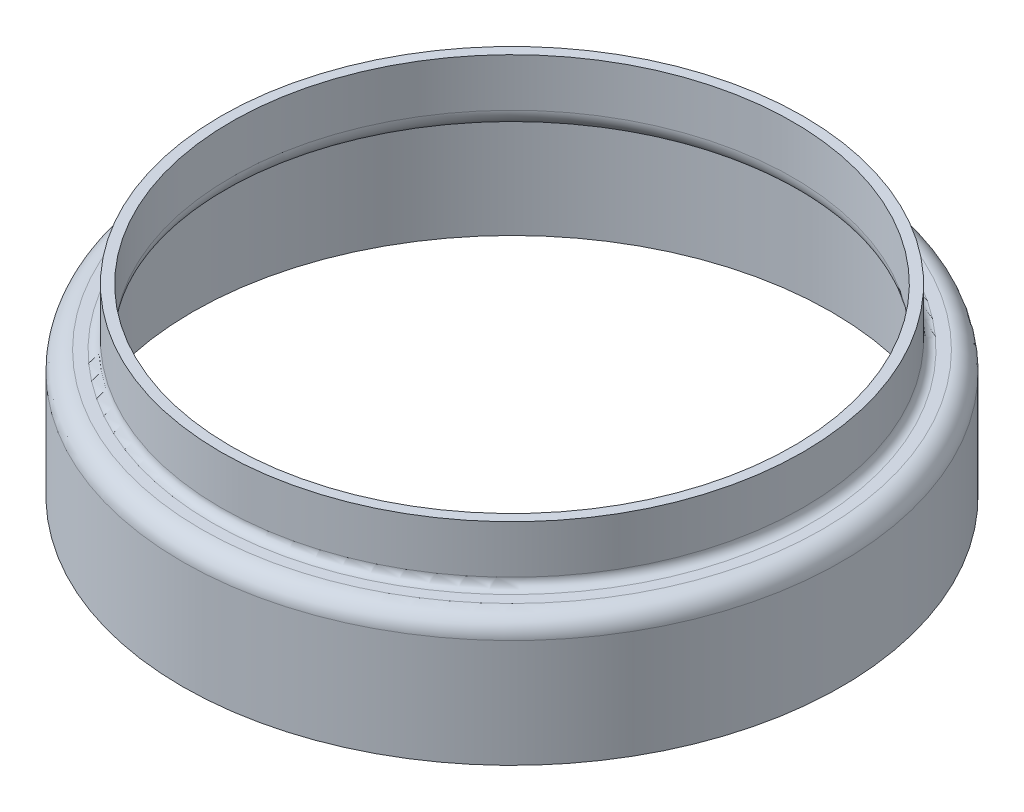
ISO-10303-21;
HEADER;
FILE_DESCRIPTION(('STEP AP214'),'2;1');
FILE_NAME('part.step','',(''),(''),'','','');
FILE_SCHEMA(('AUTOMOTIVE_DESIGN { 1 0 10303 214 1 1 1 1 }'));
ENDSEC;
DATA;
#1=APPLICATION_CONTEXT('core data for automotive mechanical design processes');
#2=APPLICATION_PROTOCOL_DEFINITION('international standard','automotive_design',2000,#1);
#3=PRODUCT_CONTEXT('',#1,'mechanical');
#4=PRODUCT('Part','Part','',(#3));
#5=PRODUCT_RELATED_PRODUCT_CATEGORY('part','',(#4));
#6=PRODUCT_DEFINITION_FORMATION('','',#4);
#7=PRODUCT_DEFINITION_CONTEXT('part definition',#1,'design');
#8=PRODUCT_DEFINITION('design','',#6,#7);
#9=PRODUCT_DEFINITION_SHAPE('','',#8);
#10=(LENGTH_UNIT() NAMED_UNIT(*) SI_UNIT(.MILLI.,.METRE.));
#11=(NAMED_UNIT(*) PLANE_ANGLE_UNIT() SI_UNIT($,.RADIAN.));
#12=(NAMED_UNIT(*) SI_UNIT($,.STERADIAN.) SOLID_ANGLE_UNIT());
#13=UNCERTAINTY_MEASURE_WITH_UNIT(LENGTH_MEASURE(1.E-05),#10,'distance_accuracy_value','');
#14=(GEOMETRIC_REPRESENTATION_CONTEXT(3) GLOBAL_UNCERTAINTY_ASSIGNED_CONTEXT((#13)) GLOBAL_UNIT_ASSIGNED_CONTEXT((#10,
#11,#12)) REPRESENTATION_CONTEXT('',''));
#15=CARTESIAN_POINT('',(0.,0.,0.));
#16=DIRECTION('',(0.,0.,1.));
#17=DIRECTION('',(1.,0.,0.));
#18=AXIS2_PLACEMENT_3D('',#15,#16,#17);
#19=CARTESIAN_POINT('',(0.,71.5790860873113,0.));
#20=DIRECTION('',(0.,1.,0.));
#21=DIRECTION('',(0.,0.,1.));
#22=AXIS2_PLACEMENT_3D('',#19,#20,#21);
#23=CYLINDRICAL_SURFACE('',#22,8.15339999999999);
#24=CARTESIAN_POINT('',(0.,4.57199999999999,0.));
#25=DIRECTION('',(0.,1.,0.));
#26=DIRECTION('',(0.,0.,1.));
#27=AXIS2_PLACEMENT_3D('',#24,#25,#26);
#28=CIRCLE('',#27,8.15339999999999);
#29=CARTESIAN_POINT('',(0.,4.57199999999999,8.15339999999999));
#30=VERTEX_POINT('',#29);
#31=EDGE_CURVE('E248',#30,#30,#28,.T.);
#32=ORIENTED_EDGE('',*,*,#31,.F.);
#33=EDGE_LOOP('',(#32));
#34=FACE_BOUND('',#33,.T.);
#35=CARTESIAN_POINT('',(0.,5.969,0.));
#36=DIRECTION('',(0.,1.,0.));
#37=DIRECTION('',(0.,0.,1.));
#38=AXIS2_PLACEMENT_3D('',#35,#36,#37);
#39=CIRCLE('',#38,8.15339999999999);
#40=CARTESIAN_POINT('',(0.,5.969,8.15339999999999));
#41=VERTEX_POINT('',#40);
#42=EDGE_CURVE('E63',#41,#41,#39,.T.);
#43=ORIENTED_EDGE('',*,*,#42,.T.);
#44=EDGE_LOOP('',(#43));
#45=FACE_BOUND('',#44,.T.);
#46=ADVANCED_FACE('F16',(#34,#45),#23,.F.);
#47=CARTESIAN_POINT('',(0.,4.572,0.));
#48=DIRECTION('',(0.,1.,0.));
#49=DIRECTION('',(0.,0.,1.));
#50=AXIS2_PLACEMENT_3D('',#47,#48,#49);
#51=TOROIDAL_SURFACE('',#50,8.69949999999999,0.5461);
#52=CARTESIAN_POINT('',(0.,4.0259,0.));
#53=DIRECTION('',(0.,-1.,0.));
#54=DIRECTION('',(0.,0.,1.));
#55=AXIS2_PLACEMENT_3D('',#52,#53,#54);
#56=CIRCLE('',#55,8.69949999999999);
#57=CARTESIAN_POINT('',(0.,4.0259,8.69949999999999));
#58=VERTEX_POINT('',#57);
#59=CARTESIAN_POINT('',(0.,4.0259,-8.69949999999999));
#60=VERTEX_POINT('',#59);
#61=EDGE_CURVE('E58',#58,#60,#56,.T.);
#62=ORIENTED_EDGE('',*,*,#61,.T.);
#63=CARTESIAN_POINT('',(0.,4.0259,0.));
#64=DIRECTION('',(0.,-1.,0.));
#65=DIRECTION('',(0.,0.,-1.));
#66=AXIS2_PLACEMENT_3D('',#63,#64,#65);
#67=CIRCLE('',#66,8.69949999999999);
#68=EDGE_CURVE('E55',#60,#58,#67,.T.);
#69=ORIENTED_EDGE('',*,*,#68,.T.);
#70=EDGE_LOOP('',(#62,#69));
#71=FACE_BOUND('',#70,.T.);
#72=ORIENTED_EDGE('',*,*,#31,.T.);
#73=EDGE_LOOP('',(#72));
#74=FACE_BOUND('',#73,.T.);
#75=ADVANCED_FACE('F59',(#71,#74),#51,.T.);
#76=CARTESIAN_POINT('',(0.,5.969,8.44549999999999));
#77=DIRECTION('',(0.,-1.,0.));
#78=DIRECTION('',(0.,0.,-1.));
#79=AXIS2_PLACEMENT_3D('',#76,#77,#78);
#80=PLANE('',#79);
#81=CARTESIAN_POINT('',(0.,5.969,0.));
#82=DIRECTION('',(0.,1.,0.));
#83=DIRECTION('',(0.,0.,1.));
#84=AXIS2_PLACEMENT_3D('',#81,#82,#83);
#85=CIRCLE('',#84,8.44549999999999);
#86=CARTESIAN_POINT('',(0.,5.969,8.44549999999999));
#87=VERTEX_POINT('',#86);
#88=EDGE_CURVE('E68',#87,#87,#85,.F.);
#89=ORIENTED_EDGE('',*,*,#88,.F.);
#90=EDGE_LOOP('',(#89));
#91=FACE_BOUND('',#90,.T.);
#92=ORIENTED_EDGE('',*,*,#42,.F.);
#93=EDGE_LOOP('',(#92));
#94=FACE_BOUND('',#93,.T.);
#95=ADVANCED_FACE('F89',(#91,#94),#80,.F.);
#96=CARTESIAN_POINT('',(0.,4.0259,8.69949999999999));
#97=DIRECTION('',(0.,1.,0.));
#98=DIRECTION('',(0.,0.,1.));
#99=AXIS2_PLACEMENT_3D('',#96,#97,#98);
#100=PLANE('',#99);
#101=ORIENTED_EDGE('',*,*,#61,.F.);
#102=ORIENTED_EDGE('',*,*,#68,.F.);
#103=EDGE_LOOP('',(#101,#102));
#104=FACE_BOUND('',#103,.T.);
#105=CARTESIAN_POINT('',(0.,4.0259,0.));
#106=DIRECTION('',(0.,1.,0.));
#107=DIRECTION('',(0.,0.,-1.));
#108=AXIS2_PLACEMENT_3D('',#105,#106,#107);
#109=CIRCLE('',#108,9.01699999999999);
#110=CARTESIAN_POINT('',(0.,4.0259,9.01699999999999));
#111=VERTEX_POINT('',#110);
#112=CARTESIAN_POINT('',(0.,4.0259,-9.01699999999999));
#113=VERTEX_POINT('',#112);
#114=EDGE_CURVE('E109',#111,#113,#109,.F.);
#115=ORIENTED_EDGE('',*,*,#114,.T.);
#116=CARTESIAN_POINT('',(0.,4.0259,0.));
#117=DIRECTION('',(0.,1.,0.));
#118=DIRECTION('',(0.,0.,1.));
#119=AXIS2_PLACEMENT_3D('',#116,#117,#118);
#120=CIRCLE('',#119,9.01699999999999);
#121=EDGE_CURVE('E108',#113,#111,#120,.F.);
#122=ORIENTED_EDGE('',*,*,#121,.T.);
#123=EDGE_LOOP('',(#115,#122));
#124=FACE_BOUND('',#123,.T.);
#125=ADVANCED_FACE('F66',(#104,#124),#100,.F.);
#126=CARTESIAN_POINT('',(0.,71.5790860873113,0.));
#127=DIRECTION('',(0.,1.,0.));
#128=DIRECTION('',(0.,0.,1.));
#129=AXIS2_PLACEMENT_3D('',#126,#127,#128);
#130=CYLINDRICAL_SURFACE('',#129,8.44549999999999);
#131=CARTESIAN_POINT('',(0.,4.57199999999999,0.));
#132=DIRECTION('',(0.,1.,0.));
#133=DIRECTION('',(0.,0.,1.));
#134=AXIS2_PLACEMENT_3D('',#131,#132,#133);
#135=CIRCLE('',#134,8.44549999999999);
#136=CARTESIAN_POINT('',(0.,4.57199999999999,8.44549999999999));
#137=VERTEX_POINT('',#136);
#138=EDGE_CURVE('E114',#137,#137,#135,.T.);
#139=ORIENTED_EDGE('',*,*,#138,.T.);
#140=EDGE_LOOP('',(#139));
#141=FACE_BOUND('',#140,.T.);
#142=ORIENTED_EDGE('',*,*,#88,.T.);
#143=EDGE_LOOP('',(#142));
#144=FACE_BOUND('',#143,.T.);
#145=ADVANCED_FACE('F88',(#141,#144),#130,.T.);
#146=CARTESIAN_POINT('',(0.,3.7719,0.));
#147=DIRECTION('',(0.,1.,0.));
#148=DIRECTION('',(0.,0.,1.));
#149=AXIS2_PLACEMENT_3D('',#146,#147,#148);
#150=TOROIDAL_SURFACE('',#149,9.01699999999999,0.254);
#151=ORIENTED_EDGE('',*,*,#114,.F.);
#152=ORIENTED_EDGE('',*,*,#121,.F.);
#153=EDGE_LOOP('',(#151,#152));
#154=FACE_BOUND('',#153,.T.);
#155=CARTESIAN_POINT('',(0.,3.77189999999999,0.));
#156=DIRECTION('',(0.,1.,0.));
#157=DIRECTION('',(0.,0.,1.));
#158=AXIS2_PLACEMENT_3D('',#155,#156,#157);
#159=CIRCLE('',#158,9.27099999999999);
#160=CARTESIAN_POINT('',(0.,3.77189999999999,9.27099999999999));
#161=VERTEX_POINT('',#160);
#162=EDGE_CURVE('E116',#161,#161,#159,.F.);
#163=ORIENTED_EDGE('',*,*,#162,.T.);
#164=EDGE_LOOP('',(#163));
#165=FACE_BOUND('',#164,.T.);
#166=ADVANCED_FACE('F112',(#154,#165),#150,.F.);
#167=CARTESIAN_POINT('',(0.,4.572,0.));
#168=DIRECTION('',(0.,1.,0.));
#169=DIRECTION('',(0.,0.,1.));
#170=AXIS2_PLACEMENT_3D('',#167,#168,#169);
#171=TOROIDAL_SURFACE('',#170,8.69949999999999,0.254);
#172=CARTESIAN_POINT('',(0.,4.318,0.));
#173=DIRECTION('',(0.,1.,0.));
#174=DIRECTION('',(0.,0.,-1.));
#175=AXIS2_PLACEMENT_3D('',#172,#173,#174);
#176=CIRCLE('',#175,8.69949999999999);
#177=CARTESIAN_POINT('',(0.,4.318,8.69949999999999));
#178=VERTEX_POINT('',#177);
#179=CARTESIAN_POINT('',(0.,4.318,-8.69949999999999));
#180=VERTEX_POINT('',#179);
#181=EDGE_CURVE('E212',#178,#180,#176,.F.);
#182=ORIENTED_EDGE('',*,*,#181,.F.);
#183=CARTESIAN_POINT('',(0.,4.318,0.));
#184=DIRECTION('',(0.,1.,0.));
#185=DIRECTION('',(0.,0.,1.));
#186=AXIS2_PLACEMENT_3D('',#183,#184,#185);
#187=CIRCLE('',#186,8.69949999999999);
#188=EDGE_CURVE('E121',#180,#178,#187,.F.);
#189=ORIENTED_EDGE('',*,*,#188,.F.);
#190=EDGE_LOOP('',(#182,#189));
#191=FACE_BOUND('',#190,.T.);
#192=ORIENTED_EDGE('',*,*,#138,.F.);
#193=EDGE_LOOP('',(#192));
#194=FACE_BOUND('',#193,.T.);
#195=ADVANCED_FACE('F129',(#191,#194),#171,.F.);
#196=CARTESIAN_POINT('',(0.,71.5790860873113,0.));
#197=DIRECTION('',(0.,1.,0.));
#198=DIRECTION('',(0.,0.,1.));
#199=AXIS2_PLACEMENT_3D('',#196,#197,#198);
#200=CYLINDRICAL_SURFACE('',#199,9.27099999999999);
#201=ORIENTED_EDGE('',*,*,#162,.F.);
#202=EDGE_LOOP('',(#201));
#203=FACE_BOUND('',#202,.T.);
#204=CARTESIAN_POINT('',(0.,0.634999999999997,0.));
#205=DIRECTION('',(0.,1.,0.));
#206=DIRECTION('',(0.,0.,1.));
#207=AXIS2_PLACEMENT_3D('',#204,#205,#206);
#208=CIRCLE('',#207,9.27099999999999);
#209=CARTESIAN_POINT('',(0.,0.634999999999997,9.27099999999999));
#210=VERTEX_POINT('',#209);
#211=EDGE_CURVE('E238',#210,#210,#208,.T.);
#212=ORIENTED_EDGE('',*,*,#211,.F.);
#213=EDGE_LOOP('',(#212));
#214=FACE_BOUND('',#213,.T.);
#215=ADVANCED_FACE('F194',(#203,#214),#200,.F.);
#216=CARTESIAN_POINT('',(0.,4.318,8.69949999999999));
#217=DIRECTION('',(0.,1.,0.));
#218=DIRECTION('',(0.,0.,1.));
#219=AXIS2_PLACEMENT_3D('',#216,#217,#218);
#220=PLANE('',#219);
#221=ORIENTED_EDGE('',*,*,#188,.T.);
#222=ORIENTED_EDGE('',*,*,#181,.T.);
#223=EDGE_LOOP('',(#221,#222));
#224=FACE_BOUND('',#223,.T.);
#225=CARTESIAN_POINT('',(0.,4.318,0.));
#226=DIRECTION('',(0.,-1.,0.));
#227=DIRECTION('',(0.,0.,-1.));
#228=AXIS2_PLACEMENT_3D('',#225,#226,#227);
#229=CIRCLE('',#228,9.01699999999999);
#230=CARTESIAN_POINT('',(0.,4.318,-9.01699999999999));
#231=VERTEX_POINT('',#230);
#232=CARTESIAN_POINT('',(0.,4.318,9.01699999999999));
#233=VERTEX_POINT('',#232);
#234=EDGE_CURVE('E182',#231,#233,#229,.T.);
#235=ORIENTED_EDGE('',*,*,#234,.F.);
#236=CARTESIAN_POINT('',(0.,4.318,0.));
#237=DIRECTION('',(0.,-1.,0.));
#238=DIRECTION('',(0.,0.,1.));
#239=AXIS2_PLACEMENT_3D('',#236,#237,#238);
#240=CIRCLE('',#239,9.01699999999999);
#241=EDGE_CURVE('E34',#233,#231,#240,.T.);
#242=ORIENTED_EDGE('',*,*,#241,.F.);
#243=EDGE_LOOP('',(#235,#242));
#244=FACE_BOUND('',#243,.T.);
#245=ADVANCED_FACE('F186',(#224,#244),#220,.T.);
#246=CARTESIAN_POINT('',(0.,0.634999999999997,-9.652));
#247=DIRECTION('',(0.,-1.,0.));
#248=DIRECTION('',(0.,0.,-1.));
#249=AXIS2_PLACEMENT_3D('',#246,#247,#248);
#250=PLANE('',#249);
#251=ORIENTED_EDGE('',*,*,#211,.T.);
#252=EDGE_LOOP('',(#251));
#253=FACE_BOUND('',#252,.T.);
#254=CARTESIAN_POINT('',(0.,0.634999999999997,0.));
#255=DIRECTION('',(0.,1.,0.));
#256=DIRECTION('',(0.,0.,1.));
#257=AXIS2_PLACEMENT_3D('',#254,#255,#256);
#258=CIRCLE('',#257,9.56309999999999);
#259=CARTESIAN_POINT('',(0.,0.634999999999997,9.56309999999999));
#260=VERTEX_POINT('',#259);
#261=EDGE_CURVE('E26',#260,#260,#258,.T.);
#262=ORIENTED_EDGE('',*,*,#261,.F.);
#263=EDGE_LOOP('',(#262));
#264=FACE_BOUND('',#263,.T.);
#265=ADVANCED_FACE('F174',(#253,#264),#250,.T.);
#266=CARTESIAN_POINT('',(0.,3.7719,0.));
#267=DIRECTION('',(0.,1.,0.));
#268=DIRECTION('',(0.,0.,1.));
#269=AXIS2_PLACEMENT_3D('',#266,#267,#268);
#270=TOROIDAL_SURFACE('',#269,9.01699999999999,0.5461);
#271=ORIENTED_EDGE('',*,*,#241,.T.);
#272=ORIENTED_EDGE('',*,*,#234,.T.);
#273=EDGE_LOOP('',(#271,#272));
#274=FACE_BOUND('',#273,.T.);
#275=CARTESIAN_POINT('',(0.,3.77189999999999,0.));
#276=DIRECTION('',(0.,1.,0.));
#277=DIRECTION('',(0.,0.,1.));
#278=AXIS2_PLACEMENT_3D('',#275,#276,#277);
#279=CIRCLE('',#278,9.56309999999999);
#280=CARTESIAN_POINT('',(0.,3.77189999999999,9.56309999999999));
#281=VERTEX_POINT('',#280);
#282=EDGE_CURVE('E11',#281,#281,#279,.F.);
#283=ORIENTED_EDGE('',*,*,#282,.F.);
#284=EDGE_LOOP('',(#283));
#285=FACE_BOUND('',#284,.T.);
#286=ADVANCED_FACE('F162',(#274,#285),#270,.T.);
#287=CARTESIAN_POINT('',(0.,71.5790860873113,0.));
#288=DIRECTION('',(0.,1.,0.));
#289=DIRECTION('',(0.,0.,1.));
#290=AXIS2_PLACEMENT_3D('',#287,#288,#289);
#291=CYLINDRICAL_SURFACE('',#290,9.56309999999999);
#292=ORIENTED_EDGE('',*,*,#282,.T.);
#293=EDGE_LOOP('',(#292));
#294=FACE_BOUND('',#293,.T.);
#295=ORIENTED_EDGE('',*,*,#261,.T.);
#296=EDGE_LOOP('',(#295));
#297=FACE_BOUND('',#296,.T.);
#298=ADVANCED_FACE('F173',(#294,#297),#291,.T.);
#299=CLOSED_SHELL('',(#46,#75,#95,#125,#145,#166,#195,#215,#245,#265,#286,#298));
#300=MANIFOLD_SOLID_BREP('B1',#299);
#301=ADVANCED_BREP_SHAPE_REPRESENTATION('',(#18,#300),#14);
#302=SHAPE_DEFINITION_REPRESENTATION(#9,#301);
ENDSEC;
END-ISO-10303-21;
